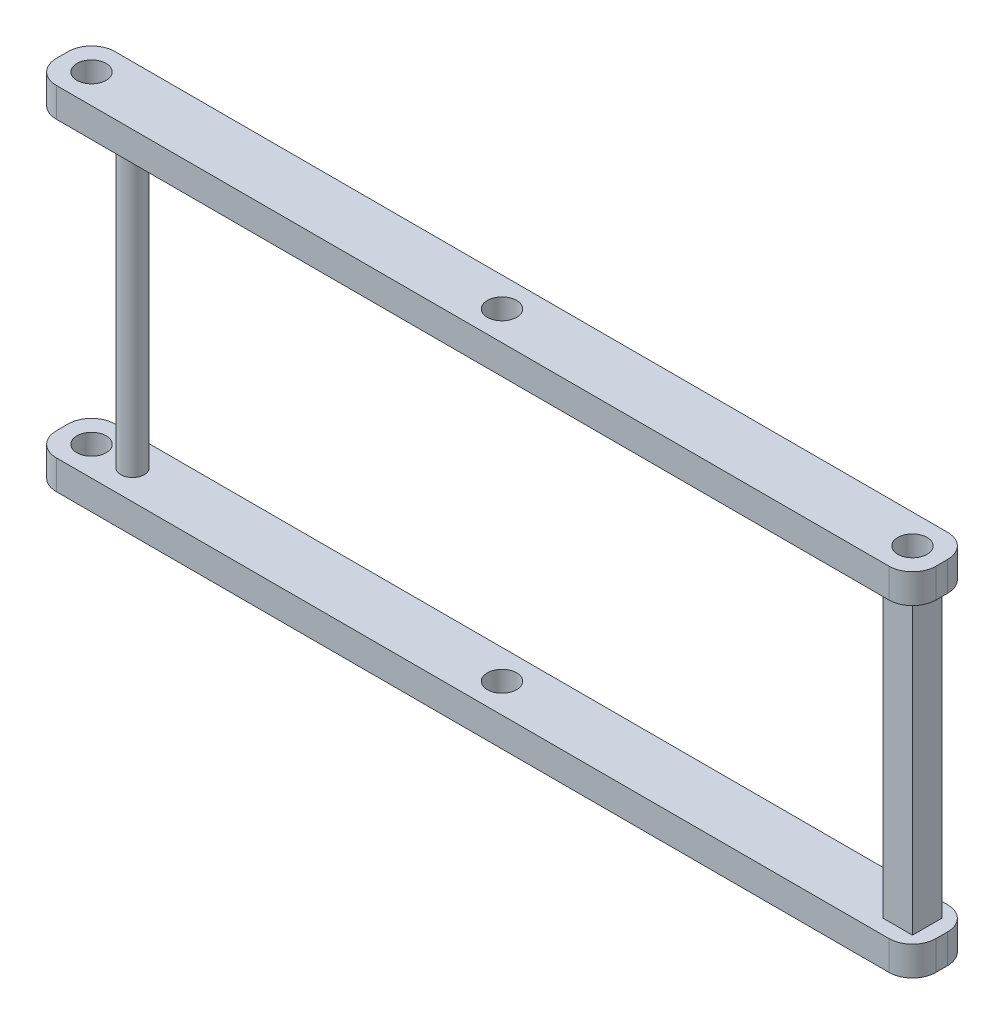
ISO-10303-21;
HEADER;
FILE_DESCRIPTION(('STEP AP214'),'2;1');
FILE_NAME('part.step','',(''),(''),'','','');
FILE_SCHEMA(('AUTOMOTIVE_DESIGN { 1 0 10303 214 1 1 1 1 }'));
ENDSEC;
DATA;
#1=APPLICATION_CONTEXT('core data for automotive mechanical design processes');
#2=APPLICATION_PROTOCOL_DEFINITION('international standard','automotive_design',2000,#1);
#3=PRODUCT_CONTEXT('',#1,'mechanical');
#4=PRODUCT('Part','Part','',(#3));
#5=PRODUCT_RELATED_PRODUCT_CATEGORY('part','',(#4));
#6=PRODUCT_DEFINITION_FORMATION('','',#4);
#7=PRODUCT_DEFINITION_CONTEXT('part definition',#1,'design');
#8=PRODUCT_DEFINITION('design','',#6,#7);
#9=PRODUCT_DEFINITION_SHAPE('','',#8);
#10=(LENGTH_UNIT() NAMED_UNIT(*) SI_UNIT(.MILLI.,.METRE.));
#11=(NAMED_UNIT(*) PLANE_ANGLE_UNIT() SI_UNIT($,.RADIAN.));
#12=(NAMED_UNIT(*) SI_UNIT($,.STERADIAN.) SOLID_ANGLE_UNIT());
#13=UNCERTAINTY_MEASURE_WITH_UNIT(LENGTH_MEASURE(1.E-05),#10,'distance_accuracy_value','');
#14=(GEOMETRIC_REPRESENTATION_CONTEXT(3) GLOBAL_UNCERTAINTY_ASSIGNED_CONTEXT((#13)) GLOBAL_UNIT_ASSIGNED_CONTEXT((#10,
#11,#12)) REPRESENTATION_CONTEXT('',''));
#15=CARTESIAN_POINT('',(0.,0.,0.));
#16=DIRECTION('',(0.,0.,1.));
#17=DIRECTION('',(1.,0.,0.));
#18=AXIS2_PLACEMENT_3D('',#15,#16,#17);
#19=CARTESIAN_POINT('',(-63.,4.99,0.));
#20=DIRECTION('',(0.,1.,0.));
#21=DIRECTION('',(0.,0.,1.));
#22=AXIS2_PLACEMENT_3D('',#19,#20,#21);
#23=CYLINDRICAL_SURFACE('',#22,2.);
#24=CARTESIAN_POINT('',(-63.,5.,0.));
#25=DIRECTION('',(0.,-1.,0.));
#26=DIRECTION('',(0.,0.,-1.));
#27=AXIS2_PLACEMENT_3D('',#24,#25,#26);
#28=CIRCLE('',#27,2.);
#29=CARTESIAN_POINT('',(-63.,5.,-1.99999999999999));
#30=VERTEX_POINT('',#29);
#31=EDGE_CURVE('E444',#30,#30,#28,.T.);
#32=ORIENTED_EDGE('',*,*,#31,.F.);
#33=EDGE_LOOP('',(#32));
#34=FACE_BOUND('',#33,.T.);
#35=CARTESIAN_POINT('',(-63.,54.999,0.));
#36=DIRECTION('',(0.,1.,0.));
#37=DIRECTION('',(0.,0.,1.));
#38=AXIS2_PLACEMENT_3D('',#35,#36,#37);
#39=CIRCLE('',#38,2.);
#40=CARTESIAN_POINT('',(-63.,54.999,2.00000000000001));
#41=VERTEX_POINT('',#40);
#42=EDGE_CURVE('E423',#41,#41,#39,.F.);
#43=ORIENTED_EDGE('',*,*,#42,.T.);
#44=EDGE_LOOP('',(#43));
#45=FACE_BOUND('',#44,.T.);
#46=ADVANCED_FACE('F194',(#34,#45),#23,.T.);
#47=CARTESIAN_POINT('',(67.5,4.99,-2.5));
#48=DIRECTION('',(0.,0.,1.));
#49=DIRECTION('',(1.,0.,0.));
#50=AXIS2_PLACEMENT_3D('',#47,#48,#49);
#51=PLANE('',#50);
#52=DIRECTION('',(-1.,0.,0.));
#53=VECTOR('',#52,1.);
#54=CARTESIAN_POINT('',(67.5,54.999,-2.5));
#55=LINE('',#54,#53);
#56=CARTESIAN_POINT('',(72.5,54.999,-2.5));
#57=VERTEX_POINT('',#56);
#58=CARTESIAN_POINT('',(67.5,54.999,-2.5));
#59=VERTEX_POINT('',#58);
#60=EDGE_CURVE('E209',#57,#59,#55,.T.);
#61=ORIENTED_EDGE('',*,*,#60,.F.);
#62=DIRECTION('',(0.,1.,0.));
#63=VECTOR('',#62,1.);
#64=CARTESIAN_POINT('',(72.5,4.99,-2.5));
#65=LINE('',#64,#63);
#66=CARTESIAN_POINT('',(72.5,5.,-2.5));
#67=VERTEX_POINT('',#66);
#68=EDGE_CURVE('E426',#67,#57,#65,.T.);
#69=ORIENTED_EDGE('',*,*,#68,.F.);
#70=DIRECTION('',(-1.,0.,0.));
#71=VECTOR('',#70,1.);
#72=CARTESIAN_POINT('',(0.,5.,-2.5));
#73=LINE('',#72,#71);
#74=CARTESIAN_POINT('',(67.5,5.,-2.5));
#75=VERTEX_POINT('',#74);
#76=EDGE_CURVE('E442',#67,#75,#73,.T.);
#77=ORIENTED_EDGE('',*,*,#76,.T.);
#78=DIRECTION('',(0.,1.,0.));
#79=VECTOR('',#78,1.);
#80=CARTESIAN_POINT('',(67.5,4.99,-2.5));
#81=LINE('',#80,#79);
#82=EDGE_CURVE('E433',#75,#59,#81,.T.);
#83=ORIENTED_EDGE('',*,*,#82,.T.);
#84=EDGE_LOOP('',(#61,#69,#77,#83));
#85=FACE_BOUND('',#84,.T.);
#86=ADVANCED_FACE('F554',(#85),#51,.F.);
#87=CARTESIAN_POINT('',(72.5,4.99,2.5));
#88=DIRECTION('',(1.,0.,0.));
#89=DIRECTION('',(0.,0.,-1.));
#90=AXIS2_PLACEMENT_3D('',#87,#88,#89);
#91=PLANE('',#90);
#92=ORIENTED_EDGE('',*,*,#68,.T.);
#93=DIRECTION('',(0.,0.,1.));
#94=VECTOR('',#93,1.);
#95=CARTESIAN_POINT('',(72.5,54.999,2.5));
#96=LINE('',#95,#94);
#97=CARTESIAN_POINT('',(72.5,54.999,2.5));
#98=VERTEX_POINT('',#97);
#99=EDGE_CURVE('E216',#57,#98,#96,.T.);
#100=ORIENTED_EDGE('',*,*,#99,.T.);
#101=DIRECTION('',(0.,1.,0.));
#102=VECTOR('',#101,1.);
#103=CARTESIAN_POINT('',(72.5,4.99,2.5));
#104=LINE('',#103,#102);
#105=CARTESIAN_POINT('',(72.5,5.,2.5));
#106=VERTEX_POINT('',#105);
#107=EDGE_CURVE('E428',#106,#98,#104,.T.);
#108=ORIENTED_EDGE('',*,*,#107,.F.);
#109=DIRECTION('',(0.,0.,1.));
#110=VECTOR('',#109,1.);
#111=CARTESIAN_POINT('',(72.5,5.,0.));
#112=LINE('',#111,#110);
#113=EDGE_CURVE('E440',#67,#106,#112,.T.);
#114=ORIENTED_EDGE('',*,*,#113,.F.);
#115=EDGE_LOOP('',(#92,#100,#108,#114));
#116=FACE_BOUND('',#115,.T.);
#117=ADVANCED_FACE('F560',(#116),#91,.T.);
#118=CARTESIAN_POINT('',(67.5,4.99,2.5));
#119=DIRECTION('',(0.,0.,1.));
#120=DIRECTION('',(1.,0.,0.));
#121=AXIS2_PLACEMENT_3D('',#118,#119,#120);
#122=PLANE('',#121);
#123=ORIENTED_EDGE('',*,*,#107,.T.);
#124=DIRECTION('',(-1.,0.,0.));
#125=VECTOR('',#124,1.);
#126=CARTESIAN_POINT('',(67.5,54.999,2.5));
#127=LINE('',#126,#125);
#128=CARTESIAN_POINT('',(67.5,54.999,2.5));
#129=VERTEX_POINT('',#128);
#130=EDGE_CURVE('E408',#98,#129,#127,.T.);
#131=ORIENTED_EDGE('',*,*,#130,.T.);
#132=DIRECTION('',(0.,1.,0.));
#133=VECTOR('',#132,1.);
#134=CARTESIAN_POINT('',(67.5,4.99,2.5));
#135=LINE('',#134,#133);
#136=CARTESIAN_POINT('',(67.5,5.,2.5));
#137=VERTEX_POINT('',#136);
#138=EDGE_CURVE('E430',#137,#129,#135,.T.);
#139=ORIENTED_EDGE('',*,*,#138,.F.);
#140=DIRECTION('',(-1.,0.,0.));
#141=VECTOR('',#140,1.);
#142=CARTESIAN_POINT('',(0.,5.,2.5));
#143=LINE('',#142,#141);
#144=EDGE_CURVE('E438',#106,#137,#143,.T.);
#145=ORIENTED_EDGE('',*,*,#144,.F.);
#146=EDGE_LOOP('',(#123,#131,#139,#145));
#147=FACE_BOUND('',#146,.T.);
#148=ADVANCED_FACE('F657',(#147),#122,.T.);
#149=CARTESIAN_POINT('',(67.5,4.99,2.5));
#150=DIRECTION('',(1.,0.,0.));
#151=DIRECTION('',(0.,0.,-1.));
#152=AXIS2_PLACEMENT_3D('',#149,#150,#151);
#153=PLANE('',#152);
#154=DIRECTION('',(0.,0.,1.));
#155=VECTOR('',#154,1.);
#156=CARTESIAN_POINT('',(67.5,54.999,2.5));
#157=LINE('',#156,#155);
#158=EDGE_CURVE('E12',#59,#129,#157,.T.);
#159=ORIENTED_EDGE('',*,*,#158,.F.);
#160=ORIENTED_EDGE('',*,*,#82,.F.);
#161=DIRECTION('',(0.,0.,1.));
#162=VECTOR('',#161,1.);
#163=CARTESIAN_POINT('',(67.5,5.,0.));
#164=LINE('',#163,#162);
#165=EDGE_CURVE('E435',#75,#137,#164,.T.);
#166=ORIENTED_EDGE('',*,*,#165,.T.);
#167=ORIENTED_EDGE('',*,*,#138,.T.);
#168=EDGE_LOOP('',(#159,#160,#166,#167));
#169=FACE_BOUND('',#168,.T.);
#170=ADVANCED_FACE('F584',(#169),#153,.F.);
#171=CARTESIAN_POINT('',(0.,5.,0.));
#172=DIRECTION('',(0.,-1.,0.));
#173=DIRECTION('',(0.,0.,-1.));
#174=AXIS2_PLACEMENT_3D('',#171,#172,#173);
#175=PLANE('',#174);
#176=ORIENTED_EDGE('',*,*,#31,.T.);
#177=EDGE_LOOP('',(#176));
#178=FACE_BOUND('',#177,.T.);
#179=DIRECTION('',(1.,0.,0.));
#180=VECTOR('',#179,1.);
#181=CARTESIAN_POINT('',(-75.,5.,5.00000000000002));
#182=LINE('',#181,#180);
#183=CARTESIAN_POINT('',(-71.,5.,5.00000000000002));
#184=VERTEX_POINT('',#183);
#185=CARTESIAN_POINT('',(71.,5.,5.));
#186=VERTEX_POINT('',#185);
#187=EDGE_CURVE('E471',#184,#186,#182,.T.);
#188=ORIENTED_EDGE('',*,*,#187,.T.);
#189=CARTESIAN_POINT('',(71.,5.,0.999999999999998));
#190=DIRECTION('',(0.,-1.,0.));
#191=DIRECTION('',(0.,0.,-1.));
#192=AXIS2_PLACEMENT_3D('',#189,#190,#191);
#193=CIRCLE('',#192,4.);
#194=CARTESIAN_POINT('',(75.,5.,0.999999999999998));
#195=VERTEX_POINT('',#194);
#196=EDGE_CURVE('E508',#186,#195,#193,.F.);
#197=ORIENTED_EDGE('',*,*,#196,.T.);
#198=DIRECTION('',(0.,0.,-1.));
#199=VECTOR('',#198,1.);
#200=CARTESIAN_POINT('',(75.,5.,5.));
#201=LINE('',#200,#199);
#202=CARTESIAN_POINT('',(75.,5.,-1.00000000000001));
#203=VERTEX_POINT('',#202);
#204=EDGE_CURVE('E461',#195,#203,#201,.T.);
#205=ORIENTED_EDGE('',*,*,#204,.T.);
#206=CARTESIAN_POINT('',(71.,5.,-1.00000000000001));
#207=DIRECTION('',(0.,-1.,0.));
#208=DIRECTION('',(0.,0.,-1.));
#209=AXIS2_PLACEMENT_3D('',#206,#207,#208);
#210=CIRCLE('',#209,4.);
#211=CARTESIAN_POINT('',(71.,5.,-5.00000000000002));
#212=VERTEX_POINT('',#211);
#213=EDGE_CURVE('E506',#203,#212,#210,.F.);
#214=ORIENTED_EDGE('',*,*,#213,.T.);
#215=DIRECTION('',(-1.,0.,0.));
#216=VECTOR('',#215,1.);
#217=CARTESIAN_POINT('',(-75.,5.,-4.99999999999998));
#218=LINE('',#217,#216);
#219=CARTESIAN_POINT('',(-71.,5.,-4.99999999999999));
#220=VERTEX_POINT('',#219);
#221=EDGE_CURVE('E464',#212,#220,#218,.T.);
#222=ORIENTED_EDGE('',*,*,#221,.T.);
#223=CARTESIAN_POINT('',(-71.,5.,-0.999999999999985));
#224=DIRECTION('',(0.,-1.,0.));
#225=DIRECTION('',(0.,0.,-1.));
#226=AXIS2_PLACEMENT_3D('',#223,#224,#225);
#227=CIRCLE('',#226,4.);
#228=CARTESIAN_POINT('',(-75.,5.,-0.999999999999985));
#229=VERTEX_POINT('',#228);
#230=EDGE_CURVE('E504',#220,#229,#227,.F.);
#231=ORIENTED_EDGE('',*,*,#230,.T.);
#232=DIRECTION('',(0.,0.,1.));
#233=VECTOR('',#232,1.);
#234=CARTESIAN_POINT('',(-75.,5.,5.00000000000002));
#235=LINE('',#234,#233);
#236=CARTESIAN_POINT('',(-75.,5.,1.00000000000002));
#237=VERTEX_POINT('',#236);
#238=EDGE_CURVE('E468',#229,#237,#235,.T.);
#239=ORIENTED_EDGE('',*,*,#238,.T.);
#240=CARTESIAN_POINT('',(-71.,5.,1.00000000000002));
#241=DIRECTION('',(0.,-1.,0.));
#242=DIRECTION('',(0.,0.,-1.));
#243=AXIS2_PLACEMENT_3D('',#240,#241,#242);
#244=CIRCLE('',#243,4.);
#245=EDGE_CURVE('E502',#237,#184,#244,.F.);
#246=ORIENTED_EDGE('',*,*,#245,.T.);
#247=EDGE_LOOP('',(#188,#197,#205,#214,#222,#231,#239,#246));
#248=FACE_BOUND('',#247,.T.);
#249=CARTESIAN_POINT('',(-70.,5.,0.));
#250=DIRECTION('',(0.,1.,0.));
#251=DIRECTION('',(0.,0.,1.));
#252=AXIS2_PLACEMENT_3D('',#249,#250,#251);
#253=CIRCLE('',#252,2.50000000000001);
#254=CARTESIAN_POINT('',(-70.,5.,2.50000000000002));
#255=VERTEX_POINT('',#254);
#256=EDGE_CURVE('E455',#255,#255,#253,.T.);
#257=ORIENTED_EDGE('',*,*,#256,.F.);
#258=EDGE_LOOP('',(#257));
#259=FACE_BOUND('',#258,.T.);
#260=CARTESIAN_POINT('',(0.,5.,0.));
#261=DIRECTION('',(0.,1.,0.));
#262=DIRECTION('',(0.,0.,1.));
#263=AXIS2_PLACEMENT_3D('',#260,#261,#262);
#264=CIRCLE('',#263,2.5);
#265=CARTESIAN_POINT('',(0.,5.,2.5));
#266=VERTEX_POINT('',#265);
#267=EDGE_CURVE('E445',#266,#266,#264,.T.);
#268=ORIENTED_EDGE('',*,*,#267,.F.);
#269=EDGE_LOOP('',(#268));
#270=FACE_BOUND('',#269,.T.);
#271=ORIENTED_EDGE('',*,*,#76,.F.);
#272=ORIENTED_EDGE('',*,*,#113,.T.);
#273=ORIENTED_EDGE('',*,*,#144,.T.);
#274=ORIENTED_EDGE('',*,*,#165,.F.);
#275=EDGE_LOOP('',(#271,#272,#273,#274));
#276=FACE_BOUND('',#275,.T.);
#277=ADVANCED_FACE('F576',(#178,#248,#259,#270,#276),#175,.F.);
#278=CARTESIAN_POINT('',(70.,5.,0.));
#279=DIRECTION('',(0.,-1.,0.));
#280=DIRECTION('',(0.,0.,-1.));
#281=AXIS2_PLACEMENT_3D('',#278,#279,#280);
#282=CYLINDRICAL_SURFACE('',#281,2.50000000000001);
#283=CARTESIAN_POINT('',(70.,0.,0.));
#284=DIRECTION('',(0.,1.,0.));
#285=DIRECTION('',(0.,0.,-1.));
#286=AXIS2_PLACEMENT_3D('',#283,#284,#285);
#287=CIRCLE('',#286,2.50000000000001);
#288=CARTESIAN_POINT('',(70.,0.,-2.50000000000001));
#289=VERTEX_POINT('',#288);
#290=EDGE_CURVE('E448',#289,#289,#287,.T.);
#291=ORIENTED_EDGE('',*,*,#290,.F.);
#292=EDGE_LOOP('',(#291));
#293=FACE_BOUND('',#292,.T.);
#294=CARTESIAN_POINT('',(70.,4.99,0.));
#295=DIRECTION('',(0.,1.,0.));
#296=DIRECTION('',(0.,0.,1.));
#297=AXIS2_PLACEMENT_3D('',#294,#295,#296);
#298=CIRCLE('',#297,2.50000000000001);
#299=CARTESIAN_POINT('',(70.,4.99,2.50000000000001));
#300=VERTEX_POINT('',#299);
#301=EDGE_CURVE('E520',#300,#300,#298,.T.);
#302=ORIENTED_EDGE('',*,*,#301,.T.);
#303=EDGE_LOOP('',(#302));
#304=FACE_BOUND('',#303,.T.);
#305=ADVANCED_FACE('F572',(#293,#304),#282,.F.);
#306=CARTESIAN_POINT('',(0.,0.,0.));
#307=DIRECTION('',(0.,-1.,0.));
#308=DIRECTION('',(0.,0.,-1.));
#309=AXIS2_PLACEMENT_3D('',#306,#307,#308);
#310=PLANE('',#309);
#311=ORIENTED_EDGE('',*,*,#290,.T.);
#312=EDGE_LOOP('',(#311));
#313=FACE_BOUND('',#312,.T.);
#314=DIRECTION('',(0.,0.,-1.));
#315=VECTOR('',#314,1.);
#316=CARTESIAN_POINT('',(75.,0.,5.));
#317=LINE('',#316,#315);
#318=CARTESIAN_POINT('',(75.,0.,0.999999999999998));
#319=VERTEX_POINT('',#318);
#320=CARTESIAN_POINT('',(75.,0.,-1.00000000000001));
#321=VERTEX_POINT('',#320);
#322=EDGE_CURVE('E458',#319,#321,#317,.T.);
#323=ORIENTED_EDGE('',*,*,#322,.F.);
#324=CARTESIAN_POINT('',(71.,0.,0.999999999999998));
#325=DIRECTION('',(0.,-1.,0.));
#326=DIRECTION('',(0.,0.,-1.));
#327=AXIS2_PLACEMENT_3D('',#324,#325,#326);
#328=CIRCLE('',#327,4.);
#329=CARTESIAN_POINT('',(71.,0.,5.));
#330=VERTEX_POINT('',#329);
#331=EDGE_CURVE('E495',#319,#330,#328,.T.);
#332=ORIENTED_EDGE('',*,*,#331,.T.);
#333=DIRECTION('',(1.,0.,0.));
#334=VECTOR('',#333,1.);
#335=CARTESIAN_POINT('',(-75.,0.,5.00000000000002));
#336=LINE('',#335,#334);
#337=CARTESIAN_POINT('',(-71.,0.,5.00000000000002));
#338=VERTEX_POINT('',#337);
#339=EDGE_CURVE('E465',#338,#330,#336,.T.);
#340=ORIENTED_EDGE('',*,*,#339,.F.);
#341=CARTESIAN_POINT('',(-71.,0.,1.00000000000002));
#342=DIRECTION('',(0.,-1.,0.));
#343=DIRECTION('',(0.,0.,-1.));
#344=AXIS2_PLACEMENT_3D('',#341,#342,#343);
#345=CIRCLE('',#344,4.);
#346=CARTESIAN_POINT('',(-75.,0.,1.00000000000002));
#347=VERTEX_POINT('',#346);
#348=EDGE_CURVE('E489',#338,#347,#345,.T.);
#349=ORIENTED_EDGE('',*,*,#348,.T.);
#350=DIRECTION('',(0.,0.,1.));
#351=VECTOR('',#350,1.);
#352=CARTESIAN_POINT('',(-75.,0.,5.00000000000002));
#353=LINE('',#352,#351);
#354=CARTESIAN_POINT('',(-75.,0.,-0.999999999999985));
#355=VERTEX_POINT('',#354);
#356=EDGE_CURVE('E480',#355,#347,#353,.T.);
#357=ORIENTED_EDGE('',*,*,#356,.F.);
#358=CARTESIAN_POINT('',(-71.,0.,-0.999999999999985));
#359=DIRECTION('',(0.,-1.,0.));
#360=DIRECTION('',(0.,0.,-1.));
#361=AXIS2_PLACEMENT_3D('',#358,#359,#360);
#362=CIRCLE('',#361,4.);
#363=CARTESIAN_POINT('',(-71.,0.,-4.99999999999999));
#364=VERTEX_POINT('',#363);
#365=EDGE_CURVE('E491',#355,#364,#362,.T.);
#366=ORIENTED_EDGE('',*,*,#365,.T.);
#367=DIRECTION('',(-1.,0.,0.));
#368=VECTOR('',#367,1.);
#369=CARTESIAN_POINT('',(-75.,0.,-4.99999999999998));
#370=LINE('',#369,#368);
#371=CARTESIAN_POINT('',(71.,0.,-5.00000000000002));
#372=VERTEX_POINT('',#371);
#373=EDGE_CURVE('E477',#372,#364,#370,.T.);
#374=ORIENTED_EDGE('',*,*,#373,.F.);
#375=CARTESIAN_POINT('',(71.,0.,-1.00000000000001));
#376=DIRECTION('',(0.,-1.,0.));
#377=DIRECTION('',(0.,0.,-1.));
#378=AXIS2_PLACEMENT_3D('',#375,#376,#377);
#379=CIRCLE('',#378,4.);
#380=EDGE_CURVE('E493',#372,#321,#379,.T.);
#381=ORIENTED_EDGE('',*,*,#380,.T.);
#382=EDGE_LOOP('',(#323,#332,#340,#349,#357,#366,#374,#381));
#383=FACE_BOUND('',#382,.T.);
#384=CARTESIAN_POINT('',(-70.,0.,0.));
#385=DIRECTION('',(0.,1.,0.));
#386=DIRECTION('',(0.,0.,1.));
#387=AXIS2_PLACEMENT_3D('',#384,#385,#386);
#388=CIRCLE('',#387,2.50000000000001);
#389=CARTESIAN_POINT('',(-70.,0.,2.50000000000002));
#390=VERTEX_POINT('',#389);
#391=EDGE_CURVE('E454',#390,#390,#388,.T.);
#392=ORIENTED_EDGE('',*,*,#391,.T.);
#393=EDGE_LOOP('',(#392));
#394=FACE_BOUND('',#393,.T.);
#395=CARTESIAN_POINT('',(0.,0.,0.));
#396=DIRECTION('',(0.,1.,0.));
#397=DIRECTION('',(0.,0.,1.));
#398=AXIS2_PLACEMENT_3D('',#395,#396,#397);
#399=CIRCLE('',#398,2.5);
#400=CARTESIAN_POINT('',(0.,0.,2.5));
#401=VERTEX_POINT('',#400);
#402=EDGE_CURVE('E449',#401,#401,#399,.T.);
#403=ORIENTED_EDGE('',*,*,#402,.T.);
#404=EDGE_LOOP('',(#403));
#405=FACE_BOUND('',#404,.T.);
#406=ADVANCED_FACE('F575',(#313,#383,#394,#405),#310,.T.);
#407=CARTESIAN_POINT('',(75.,5.,5.));
#408=DIRECTION('',(-1.,0.,0.));
#409=DIRECTION('',(0.,0.,1.));
#410=AXIS2_PLACEMENT_3D('',#407,#408,#409);
#411=PLANE('',#410);
#412=ORIENTED_EDGE('',*,*,#204,.F.);
#413=DIRECTION('',(0.,-1.,0.));
#414=VECTOR('',#413,1.);
#415=CARTESIAN_POINT('',(75.,5.,0.999999999999998));
#416=LINE('',#415,#414);
#417=EDGE_CURVE('E486',#195,#319,#416,.T.);
#418=ORIENTED_EDGE('',*,*,#417,.T.);
#419=ORIENTED_EDGE('',*,*,#322,.T.);
#420=DIRECTION('',(0.,-1.,0.));
#421=VECTOR('',#420,1.);
#422=CARTESIAN_POINT('',(75.,5.,-1.00000000000001));
#423=LINE('',#422,#421);
#424=EDGE_CURVE('E474',#321,#203,#423,.F.);
#425=ORIENTED_EDGE('',*,*,#424,.T.);
#426=EDGE_LOOP('',(#412,#418,#419,#425));
#427=FACE_BOUND('',#426,.T.);
#428=ADVANCED_FACE('F588',(#427),#411,.F.);
#429=CARTESIAN_POINT('',(-75.,5.,-4.99999999999998));
#430=DIRECTION('',(0.,0.,1.));
#431=DIRECTION('',(1.,0.,0.));
#432=AXIS2_PLACEMENT_3D('',#429,#430,#431);
#433=PLANE('',#432);
#434=ORIENTED_EDGE('',*,*,#221,.F.);
#435=DIRECTION('',(0.,-1.,0.));
#436=VECTOR('',#435,1.);
#437=CARTESIAN_POINT('',(71.,5.,-5.00000000000002));
#438=LINE('',#437,#436);
#439=EDGE_CURVE('E512',#212,#372,#438,.T.);
#440=ORIENTED_EDGE('',*,*,#439,.T.);
#441=ORIENTED_EDGE('',*,*,#373,.T.);
#442=DIRECTION('',(0.,-1.,0.));
#443=VECTOR('',#442,1.);
#444=CARTESIAN_POINT('',(-71.,5.,-4.99999999999999));
#445=LINE('',#444,#443);
#446=EDGE_CURVE('E510',#364,#220,#445,.F.);
#447=ORIENTED_EDGE('',*,*,#446,.T.);
#448=EDGE_LOOP('',(#434,#440,#441,#447));
#449=FACE_BOUND('',#448,.T.);
#450=ADVANCED_FACE('F596',(#449),#433,.F.);
#451=CARTESIAN_POINT('',(-75.,5.,5.00000000000002));
#452=DIRECTION('',(1.,0.,0.));
#453=DIRECTION('',(0.,0.,-1.));
#454=AXIS2_PLACEMENT_3D('',#451,#452,#453);
#455=PLANE('',#454);
#456=ORIENTED_EDGE('',*,*,#238,.F.);
#457=DIRECTION('',(0.,-1.,0.));
#458=VECTOR('',#457,1.);
#459=CARTESIAN_POINT('',(-75.,5.,-0.999999999999985));
#460=LINE('',#459,#458);
#461=EDGE_CURVE('E517',#229,#355,#460,.T.);
#462=ORIENTED_EDGE('',*,*,#461,.T.);
#463=ORIENTED_EDGE('',*,*,#356,.T.);
#464=DIRECTION('',(0.,-1.,0.));
#465=VECTOR('',#464,1.);
#466=CARTESIAN_POINT('',(-75.,5.,1.00000000000002));
#467=LINE('',#466,#465);
#468=EDGE_CURVE('E515',#347,#237,#467,.F.);
#469=ORIENTED_EDGE('',*,*,#468,.T.);
#470=EDGE_LOOP('',(#456,#462,#463,#469));
#471=FACE_BOUND('',#470,.T.);
#472=ADVANCED_FACE('F592',(#471),#455,.F.);
#473=CARTESIAN_POINT('',(-75.,5.,5.00000000000002));
#474=DIRECTION('',(0.,0.,-1.));
#475=DIRECTION('',(-1.,0.,0.));
#476=AXIS2_PLACEMENT_3D('',#473,#474,#475);
#477=PLANE('',#476);
#478=ORIENTED_EDGE('',*,*,#339,.T.);
#479=DIRECTION('',(0.,-1.,0.));
#480=VECTOR('',#479,1.);
#481=CARTESIAN_POINT('',(71.,5.,5.));
#482=LINE('',#481,#480);
#483=EDGE_CURVE('E500',#330,#186,#482,.F.);
#484=ORIENTED_EDGE('',*,*,#483,.T.);
#485=ORIENTED_EDGE('',*,*,#187,.F.);
#486=DIRECTION('',(0.,-1.,0.));
#487=VECTOR('',#486,1.);
#488=CARTESIAN_POINT('',(-71.,5.,5.00000000000002));
#489=LINE('',#488,#487);
#490=EDGE_CURVE('E497',#184,#338,#489,.T.);
#491=ORIENTED_EDGE('',*,*,#490,.T.);
#492=EDGE_LOOP('',(#478,#484,#485,#491));
#493=FACE_BOUND('',#492,.T.);
#494=ADVANCED_FACE('F580',(#493),#477,.F.);
#495=CARTESIAN_POINT('',(-70.,5.,0.));
#496=DIRECTION('',(0.,-1.,0.));
#497=DIRECTION('',(0.,0.,-1.));
#498=AXIS2_PLACEMENT_3D('',#495,#496,#497);
#499=CYLINDRICAL_SURFACE('',#498,2.50000000000001);
#500=ORIENTED_EDGE('',*,*,#256,.T.);
#501=EDGE_LOOP('',(#500));
#502=FACE_BOUND('',#501,.T.);
#503=ORIENTED_EDGE('',*,*,#391,.F.);
#504=EDGE_LOOP('',(#503));
#505=FACE_BOUND('',#504,.T.);
#506=ADVANCED_FACE('F570',(#502,#505),#499,.F.);
#507=CARTESIAN_POINT('',(0.,5.,0.));
#508=DIRECTION('',(0.,-1.,0.));
#509=DIRECTION('',(0.,0.,-1.));
#510=AXIS2_PLACEMENT_3D('',#507,#508,#509);
#511=CYLINDRICAL_SURFACE('',#510,2.5);
#512=ORIENTED_EDGE('',*,*,#267,.T.);
#513=EDGE_LOOP('',(#512));
#514=FACE_BOUND('',#513,.T.);
#515=ORIENTED_EDGE('',*,*,#402,.F.);
#516=EDGE_LOOP('',(#515));
#517=FACE_BOUND('',#516,.T.);
#518=ADVANCED_FACE('F566',(#514,#517),#511,.F.);
#519=CARTESIAN_POINT('',(71.,5.,0.999999999999998));
#520=DIRECTION('',(0.,-1.,0.));
#521=DIRECTION('',(0.,0.,-1.));
#522=AXIS2_PLACEMENT_3D('',#519,#520,#521);
#523=CYLINDRICAL_SURFACE('',#522,4.);
#524=ORIENTED_EDGE('',*,*,#196,.F.);
#525=ORIENTED_EDGE('',*,*,#483,.F.);
#526=ORIENTED_EDGE('',*,*,#331,.F.);
#527=ORIENTED_EDGE('',*,*,#417,.F.);
#528=EDGE_LOOP('',(#524,#525,#526,#527));
#529=FACE_BOUND('',#528,.T.);
#530=ADVANCED_FACE('F569',(#529),#523,.T.);
#531=CARTESIAN_POINT('',(71.,5.,-1.00000000000001));
#532=DIRECTION('',(0.,-1.,0.));
#533=DIRECTION('',(0.,0.,-1.));
#534=AXIS2_PLACEMENT_3D('',#531,#532,#533);
#535=CYLINDRICAL_SURFACE('',#534,4.);
#536=ORIENTED_EDGE('',*,*,#213,.F.);
#537=ORIENTED_EDGE('',*,*,#424,.F.);
#538=ORIENTED_EDGE('',*,*,#380,.F.);
#539=ORIENTED_EDGE('',*,*,#439,.F.);
#540=EDGE_LOOP('',(#536,#537,#538,#539));
#541=FACE_BOUND('',#540,.T.);
#542=ADVANCED_FACE('F606',(#541),#535,.T.);
#543=CARTESIAN_POINT('',(-71.,5.,-0.999999999999985));
#544=DIRECTION('',(0.,-1.,0.));
#545=DIRECTION('',(0.,0.,-1.));
#546=AXIS2_PLACEMENT_3D('',#543,#544,#545);
#547=CYLINDRICAL_SURFACE('',#546,4.);
#548=ORIENTED_EDGE('',*,*,#230,.F.);
#549=ORIENTED_EDGE('',*,*,#446,.F.);
#550=ORIENTED_EDGE('',*,*,#365,.F.);
#551=ORIENTED_EDGE('',*,*,#461,.F.);
#552=EDGE_LOOP('',(#548,#549,#550,#551));
#553=FACE_BOUND('',#552,.T.);
#554=ADVANCED_FACE('F609',(#553),#547,.T.);
#555=CARTESIAN_POINT('',(-71.,5.,1.00000000000002));
#556=DIRECTION('',(0.,-1.,0.));
#557=DIRECTION('',(0.,0.,-1.));
#558=AXIS2_PLACEMENT_3D('',#555,#556,#557);
#559=CYLINDRICAL_SURFACE('',#558,4.);
#560=ORIENTED_EDGE('',*,*,#245,.F.);
#561=ORIENTED_EDGE('',*,*,#468,.F.);
#562=ORIENTED_EDGE('',*,*,#348,.F.);
#563=ORIENTED_EDGE('',*,*,#490,.F.);
#564=EDGE_LOOP('',(#560,#561,#562,#563));
#565=FACE_BOUND('',#564,.T.);
#566=ADVANCED_FACE('F196',(#565),#559,.T.);
#567=CARTESIAN_POINT('',(0.,4.99,0.));
#568=DIRECTION('',(0.,1.,0.));
#569=DIRECTION('',(0.,0.,1.));
#570=AXIS2_PLACEMENT_3D('',#567,#568,#569);
#571=PLANE('',#570);
#572=ORIENTED_EDGE('',*,*,#301,.F.);
#573=EDGE_LOOP('',(#572));
#574=FACE_BOUND('',#573,.T.);
#575=ADVANCED_FACE('F616',(#574),#571,.F.);
#576=CARTESIAN_POINT('',(-71.,54.999,-0.999999999999985));
#577=DIRECTION('',(0.,1.,0.));
#578=DIRECTION('',(0.,0.,1.));
#579=AXIS2_PLACEMENT_3D('',#576,#577,#578);
#580=PLANE('',#579);
#581=ORIENTED_EDGE('',*,*,#42,.F.);
#582=EDGE_LOOP('',(#581));
#583=FACE_BOUND('',#582,.T.);
#584=CARTESIAN_POINT('',(0.,54.999,0.));
#585=DIRECTION('',(0.,1.,0.));
#586=DIRECTION('',(0.,0.,1.));
#587=AXIS2_PLACEMENT_3D('',#584,#585,#586);
#588=CIRCLE('',#587,2.5);
#589=CARTESIAN_POINT('',(0.,54.999,2.5));
#590=VERTEX_POINT('',#589);
#591=EDGE_CURVE('E380',#590,#590,#588,.T.);
#592=ORIENTED_EDGE('',*,*,#591,.T.);
#593=EDGE_LOOP('',(#592));
#594=FACE_BOUND('',#593,.T.);
#595=CARTESIAN_POINT('',(-70.,54.999,0.));
#596=DIRECTION('',(0.,1.,0.));
#597=DIRECTION('',(0.,0.,1.));
#598=AXIS2_PLACEMENT_3D('',#595,#596,#597);
#599=CIRCLE('',#598,2.50000000000001);
#600=CARTESIAN_POINT('',(-70.,54.999,2.50000000000002));
#601=VERTEX_POINT('',#600);
#602=EDGE_CURVE('E383',#601,#601,#599,.T.);
#603=ORIENTED_EDGE('',*,*,#602,.T.);
#604=EDGE_LOOP('',(#603));
#605=FACE_BOUND('',#604,.T.);
#606=CARTESIAN_POINT('',(-71.,54.999,-0.999999999999985));
#607=DIRECTION('',(0.,1.,0.));
#608=DIRECTION('',(0.,0.,1.));
#609=AXIS2_PLACEMENT_3D('',#606,#607,#608);
#610=CIRCLE('',#609,4.);
#611=CARTESIAN_POINT('',(-71.,54.999,-4.99999999999999));
#612=VERTEX_POINT('',#611);
#613=CARTESIAN_POINT('',(-75.,54.999,-0.999999999999985));
#614=VERTEX_POINT('',#613);
#615=EDGE_CURVE('E339',#612,#614,#610,.T.);
#616=ORIENTED_EDGE('',*,*,#615,.F.);
#617=DIRECTION('',(-1.,0.,0.));
#618=VECTOR('',#617,1.);
#619=CARTESIAN_POINT('',(71.,54.999,-5.00000000000002));
#620=LINE('',#619,#618);
#621=CARTESIAN_POINT('',(71.,54.999,-5.00000000000002));
#622=VERTEX_POINT('',#621);
#623=EDGE_CURVE('E344',#622,#612,#620,.T.);
#624=ORIENTED_EDGE('',*,*,#623,.F.);
#625=CARTESIAN_POINT('',(71.,54.999,-1.00000000000001));
#626=DIRECTION('',(0.,1.,0.));
#627=DIRECTION('',(0.,0.,1.));
#628=AXIS2_PLACEMENT_3D('',#625,#626,#627);
#629=CIRCLE('',#628,4.);
#630=CARTESIAN_POINT('',(75.,54.999,-1.00000000000001));
#631=VERTEX_POINT('',#630);
#632=EDGE_CURVE('E401',#631,#622,#629,.T.);
#633=ORIENTED_EDGE('',*,*,#632,.F.);
#634=DIRECTION('',(0.,0.,-1.));
#635=VECTOR('',#634,1.);
#636=CARTESIAN_POINT('',(75.,54.999,0.999999999999998));
#637=LINE('',#636,#635);
#638=CARTESIAN_POINT('',(75.,54.999,0.999999999999999));
#639=VERTEX_POINT('',#638);
#640=EDGE_CURVE('E398',#639,#631,#637,.T.);
#641=ORIENTED_EDGE('',*,*,#640,.F.);
#642=CARTESIAN_POINT('',(71.,54.999,0.999999999999998));
#643=DIRECTION('',(0.,1.,0.));
#644=DIRECTION('',(0.,0.,1.));
#645=AXIS2_PLACEMENT_3D('',#642,#643,#644);
#646=CIRCLE('',#645,4.);
#647=CARTESIAN_POINT('',(71.,54.999,5.));
#648=VERTEX_POINT('',#647);
#649=EDGE_CURVE('E395',#648,#639,#646,.T.);
#650=ORIENTED_EDGE('',*,*,#649,.F.);
#651=DIRECTION('',(1.,0.,0.));
#652=VECTOR('',#651,1.);
#653=CARTESIAN_POINT('',(-71.,54.999,5.00000000000002));
#654=LINE('',#653,#652);
#655=CARTESIAN_POINT('',(-71.,54.999,5.00000000000002));
#656=VERTEX_POINT('',#655);
#657=EDGE_CURVE('E392',#656,#648,#654,.T.);
#658=ORIENTED_EDGE('',*,*,#657,.F.);
#659=CARTESIAN_POINT('',(-71.,54.999,1.00000000000002));
#660=DIRECTION('',(0.,1.,0.));
#661=DIRECTION('',(0.,0.,1.));
#662=AXIS2_PLACEMENT_3D('',#659,#660,#661);
#663=CIRCLE('',#662,4.);
#664=CARTESIAN_POINT('',(-75.,54.999,1.00000000000002));
#665=VERTEX_POINT('',#664);
#666=EDGE_CURVE('E389',#665,#656,#663,.T.);
#667=ORIENTED_EDGE('',*,*,#666,.F.);
#668=DIRECTION('',(0.,0.,1.));
#669=VECTOR('',#668,1.);
#670=CARTESIAN_POINT('',(-75.,54.999,-0.999999999999985));
#671=LINE('',#670,#669);
#672=EDGE_CURVE('E387',#614,#665,#671,.T.);
#673=ORIENTED_EDGE('',*,*,#672,.F.);
#674=EDGE_LOOP('',(#616,#624,#633,#641,#650,#658,#667,#673));
#675=FACE_BOUND('',#674,.T.);
#676=ORIENTED_EDGE('',*,*,#99,.F.);
#677=ORIENTED_EDGE('',*,*,#60,.T.);
#678=ORIENTED_EDGE('',*,*,#158,.T.);
#679=ORIENTED_EDGE('',*,*,#130,.F.);
#680=EDGE_LOOP('',(#676,#677,#678,#679));
#681=FACE_BOUND('',#680,.T.);
#682=ADVANCED_FACE('F660',(#583,#594,#605,#675,#681),#580,.F.);
#683=CARTESIAN_POINT('',(-71.,54.999,-0.999999999999985));
#684=DIRECTION('',(0.,1.,0.));
#685=DIRECTION('',(0.,0.,1.));
#686=AXIS2_PLACEMENT_3D('',#683,#684,#685);
#687=CYLINDRICAL_SURFACE('',#686,4.);
#688=DIRECTION('',(0.,1.,0.));
#689=VECTOR('',#688,1.);
#690=CARTESIAN_POINT('',(-75.,54.999,-0.999999999999985));
#691=LINE('',#690,#689);
#692=CARTESIAN_POINT('',(-75.,60.,-0.999999999999985));
#693=VERTEX_POINT('',#692);
#694=EDGE_CURVE('E333',#614,#693,#691,.T.);
#695=ORIENTED_EDGE('',*,*,#694,.T.);
#696=CARTESIAN_POINT('',(-71.,60.,-0.999999999999985));
#697=DIRECTION('',(0.,1.,0.));
#698=DIRECTION('',(0.,0.,1.));
#699=AXIS2_PLACEMENT_3D('',#696,#697,#698);
#700=CIRCLE('',#699,4.);
#701=CARTESIAN_POINT('',(-71.,60.,-4.99999999999999));
#702=VERTEX_POINT('',#701);
#703=EDGE_CURVE('E337',#702,#693,#700,.T.);
#704=ORIENTED_EDGE('',*,*,#703,.F.);
#705=DIRECTION('',(0.,1.,0.));
#706=VECTOR('',#705,1.);
#707=CARTESIAN_POINT('',(-71.,54.999,-4.99999999999999));
#708=LINE('',#707,#706);
#709=EDGE_CURVE('E406',#612,#702,#708,.T.);
#710=ORIENTED_EDGE('',*,*,#709,.F.);
#711=ORIENTED_EDGE('',*,*,#615,.T.);
#712=EDGE_LOOP('',(#695,#704,#710,#711));
#713=FACE_BOUND('',#712,.T.);
#714=ADVANCED_FACE('F335',(#713),#687,.T.);
#715=CARTESIAN_POINT('',(71.,54.999,-5.00000000000002));
#716=DIRECTION('',(0.,0.,-1.));
#717=DIRECTION('',(-1.,0.,0.));
#718=AXIS2_PLACEMENT_3D('',#715,#716,#717);
#719=PLANE('',#718);
#720=ORIENTED_EDGE('',*,*,#709,.T.);
#721=DIRECTION('',(-1.,0.,0.));
#722=VECTOR('',#721,1.);
#723=CARTESIAN_POINT('',(71.,60.,-5.00000000000002));
#724=LINE('',#723,#722);
#725=CARTESIAN_POINT('',(71.,60.,-5.00000000000002));
#726=VERTEX_POINT('',#725);
#727=EDGE_CURVE('E359',#726,#702,#724,.T.);
#728=ORIENTED_EDGE('',*,*,#727,.F.);
#729=DIRECTION('',(0.,1.,0.));
#730=VECTOR('',#729,1.);
#731=CARTESIAN_POINT('',(71.,54.999,-5.00000000000002));
#732=LINE('',#731,#730);
#733=EDGE_CURVE('E409',#622,#726,#732,.T.);
#734=ORIENTED_EDGE('',*,*,#733,.F.);
#735=ORIENTED_EDGE('',*,*,#623,.T.);
#736=EDGE_LOOP('',(#720,#728,#734,#735));
#737=FACE_BOUND('',#736,.T.);
#738=ADVANCED_FACE('F682',(#737),#719,.T.);
#739=CARTESIAN_POINT('',(71.,54.999,-1.00000000000001));
#740=DIRECTION('',(0.,1.,0.));
#741=DIRECTION('',(0.,0.,1.));
#742=AXIS2_PLACEMENT_3D('',#739,#740,#741);
#743=CYLINDRICAL_SURFACE('',#742,4.);
#744=ORIENTED_EDGE('',*,*,#733,.T.);
#745=CARTESIAN_POINT('',(71.,60.,-1.00000000000001));
#746=DIRECTION('',(0.,1.,0.));
#747=DIRECTION('',(0.,0.,1.));
#748=AXIS2_PLACEMENT_3D('',#745,#746,#747);
#749=CIRCLE('',#748,4.);
#750=CARTESIAN_POINT('',(75.,60.,-1.00000000000001));
#751=VERTEX_POINT('',#750);
#752=EDGE_CURVE('E377',#751,#726,#749,.T.);
#753=ORIENTED_EDGE('',*,*,#752,.F.);
#754=DIRECTION('',(0.,1.,0.));
#755=VECTOR('',#754,1.);
#756=CARTESIAN_POINT('',(75.,54.999,-1.00000000000001));
#757=LINE('',#756,#755);
#758=EDGE_CURVE('E411',#631,#751,#757,.T.);
#759=ORIENTED_EDGE('',*,*,#758,.F.);
#760=ORIENTED_EDGE('',*,*,#632,.T.);
#761=EDGE_LOOP('',(#744,#753,#759,#760));
#762=FACE_BOUND('',#761,.T.);
#763=ADVANCED_FACE('F690',(#762),#743,.T.);
#764=CARTESIAN_POINT('',(75.,54.999,0.999999999999998));
#765=DIRECTION('',(1.,0.,0.));
#766=DIRECTION('',(0.,0.,-1.));
#767=AXIS2_PLACEMENT_3D('',#764,#765,#766);
#768=PLANE('',#767);
#769=ORIENTED_EDGE('',*,*,#758,.T.);
#770=DIRECTION('',(0.,0.,-1.));
#771=VECTOR('',#770,1.);
#772=CARTESIAN_POINT('',(75.,60.,0.999999999999998));
#773=LINE('',#772,#771);
#774=CARTESIAN_POINT('',(75.,60.,0.999999999999999));
#775=VERTEX_POINT('',#774);
#776=EDGE_CURVE('E374',#775,#751,#773,.T.);
#777=ORIENTED_EDGE('',*,*,#776,.F.);
#778=DIRECTION('',(0.,1.,0.));
#779=VECTOR('',#778,1.);
#780=CARTESIAN_POINT('',(75.,54.999,0.999999999999999));
#781=LINE('',#780,#779);
#782=EDGE_CURVE('E413',#639,#775,#781,.T.);
#783=ORIENTED_EDGE('',*,*,#782,.F.);
#784=ORIENTED_EDGE('',*,*,#640,.T.);
#785=EDGE_LOOP('',(#769,#777,#783,#784));
#786=FACE_BOUND('',#785,.T.);
#787=ADVANCED_FACE('F694',(#786),#768,.T.);
#788=CARTESIAN_POINT('',(71.,54.999,0.999999999999998));
#789=DIRECTION('',(0.,1.,0.));
#790=DIRECTION('',(0.,0.,1.));
#791=AXIS2_PLACEMENT_3D('',#788,#789,#790);
#792=CYLINDRICAL_SURFACE('',#791,4.);
#793=ORIENTED_EDGE('',*,*,#782,.T.);
#794=CARTESIAN_POINT('',(71.,60.,0.999999999999998));
#795=DIRECTION('',(0.,1.,0.));
#796=DIRECTION('',(0.,0.,1.));
#797=AXIS2_PLACEMENT_3D('',#794,#795,#796);
#798=CIRCLE('',#797,4.);
#799=CARTESIAN_POINT('',(71.,60.,5.));
#800=VERTEX_POINT('',#799);
#801=EDGE_CURVE('E371',#800,#775,#798,.T.);
#802=ORIENTED_EDGE('',*,*,#801,.F.);
#803=DIRECTION('',(0.,1.,0.));
#804=VECTOR('',#803,1.);
#805=CARTESIAN_POINT('',(71.,54.999,5.));
#806=LINE('',#805,#804);
#807=EDGE_CURVE('E415',#648,#800,#806,.T.);
#808=ORIENTED_EDGE('',*,*,#807,.F.);
#809=ORIENTED_EDGE('',*,*,#649,.T.);
#810=EDGE_LOOP('',(#793,#802,#808,#809));
#811=FACE_BOUND('',#810,.T.);
#812=ADVANCED_FACE('F698',(#811),#792,.T.);
#813=CARTESIAN_POINT('',(-71.,54.999,5.00000000000002));
#814=DIRECTION('',(0.,0.,1.));
#815=DIRECTION('',(1.,0.,0.));
#816=AXIS2_PLACEMENT_3D('',#813,#814,#815);
#817=PLANE('',#816);
#818=ORIENTED_EDGE('',*,*,#807,.T.);
#819=DIRECTION('',(1.,0.,0.));
#820=VECTOR('',#819,1.);
#821=CARTESIAN_POINT('',(-71.,60.,5.00000000000002));
#822=LINE('',#821,#820);
#823=CARTESIAN_POINT('',(-71.,60.,5.00000000000002));
#824=VERTEX_POINT('',#823);
#825=EDGE_CURVE('E368',#824,#800,#822,.T.);
#826=ORIENTED_EDGE('',*,*,#825,.F.);
#827=DIRECTION('',(0.,1.,0.));
#828=VECTOR('',#827,1.);
#829=CARTESIAN_POINT('',(-71.,54.999,5.00000000000002));
#830=LINE('',#829,#828);
#831=EDGE_CURVE('E417',#656,#824,#830,.T.);
#832=ORIENTED_EDGE('',*,*,#831,.F.);
#833=ORIENTED_EDGE('',*,*,#657,.T.);
#834=EDGE_LOOP('',(#818,#826,#832,#833));
#835=FACE_BOUND('',#834,.T.);
#836=ADVANCED_FACE('F702',(#835),#817,.T.);
#837=CARTESIAN_POINT('',(-71.,54.999,1.00000000000002));
#838=DIRECTION('',(0.,1.,0.));
#839=DIRECTION('',(0.,0.,1.));
#840=AXIS2_PLACEMENT_3D('',#837,#838,#839);
#841=CYLINDRICAL_SURFACE('',#840,4.);
#842=ORIENTED_EDGE('',*,*,#831,.T.);
#843=CARTESIAN_POINT('',(-71.,60.,1.00000000000002));
#844=DIRECTION('',(0.,1.,0.));
#845=DIRECTION('',(0.,0.,1.));
#846=AXIS2_PLACEMENT_3D('',#843,#844,#845);
#847=CIRCLE('',#846,4.);
#848=CARTESIAN_POINT('',(-75.,60.,1.00000000000002));
#849=VERTEX_POINT('',#848);
#850=EDGE_CURVE('E352',#849,#824,#847,.T.);
#851=ORIENTED_EDGE('',*,*,#850,.F.);
#852=DIRECTION('',(0.,1.,0.));
#853=VECTOR('',#852,1.);
#854=CARTESIAN_POINT('',(-75.,54.999,1.00000000000002));
#855=LINE('',#854,#853);
#856=EDGE_CURVE('E343',#665,#849,#855,.T.);
#857=ORIENTED_EDGE('',*,*,#856,.F.);
#858=ORIENTED_EDGE('',*,*,#666,.T.);
#859=EDGE_LOOP('',(#842,#851,#857,#858));
#860=FACE_BOUND('',#859,.T.);
#861=ADVANCED_FACE('F706',(#860),#841,.T.);
#862=CARTESIAN_POINT('',(-75.,54.999,-0.999999999999985));
#863=DIRECTION('',(-1.,0.,0.));
#864=DIRECTION('',(0.,0.,1.));
#865=AXIS2_PLACEMENT_3D('',#862,#863,#864);
#866=PLANE('',#865);
#867=ORIENTED_EDGE('',*,*,#856,.T.);
#868=DIRECTION('',(0.,0.,1.));
#869=VECTOR('',#868,1.);
#870=CARTESIAN_POINT('',(-75.,60.,-0.999999999999985));
#871=LINE('',#870,#869);
#872=EDGE_CURVE('E347',#693,#849,#871,.T.);
#873=ORIENTED_EDGE('',*,*,#872,.F.);
#874=ORIENTED_EDGE('',*,*,#694,.F.);
#875=ORIENTED_EDGE('',*,*,#672,.T.);
#876=EDGE_LOOP('',(#867,#873,#874,#875));
#877=FACE_BOUND('',#876,.T.);
#878=ADVANCED_FACE('F348',(#877),#866,.T.);
#879=CARTESIAN_POINT('',(-70.,54.999,0.));
#880=DIRECTION('',(0.,1.,0.));
#881=DIRECTION('',(0.,0.,1.));
#882=AXIS2_PLACEMENT_3D('',#879,#880,#881);
#883=CYLINDRICAL_SURFACE('',#882,2.50000000000001);
#884=ORIENTED_EDGE('',*,*,#602,.F.);
#885=EDGE_LOOP('',(#884));
#886=FACE_BOUND('',#885,.T.);
#887=CARTESIAN_POINT('',(-70.,60.,0.));
#888=DIRECTION('',(0.,1.,0.));
#889=DIRECTION('',(0.,0.,1.));
#890=AXIS2_PLACEMENT_3D('',#887,#888,#889);
#891=CIRCLE('',#890,2.50000000000001);
#892=CARTESIAN_POINT('',(-70.,60.,2.50000000000002));
#893=VERTEX_POINT('',#892);
#894=EDGE_CURVE('E360',#893,#893,#891,.T.);
#895=ORIENTED_EDGE('',*,*,#894,.T.);
#896=EDGE_LOOP('',(#895));
#897=FACE_BOUND('',#896,.T.);
#898=ADVANCED_FACE('F533',(#886,#897),#883,.F.);
#899=CARTESIAN_POINT('',(70.,54.999,0.));
#900=DIRECTION('',(0.,1.,0.));
#901=DIRECTION('',(0.,0.,1.));
#902=AXIS2_PLACEMENT_3D('',#899,#900,#901);
#903=CYLINDRICAL_SURFACE('',#902,2.50000000000001);
#904=CARTESIAN_POINT('',(70.,55.,0.));
#905=DIRECTION('',(0.,1.,0.));
#906=DIRECTION('',(0.,0.,1.));
#907=AXIS2_PLACEMENT_3D('',#904,#905,#906);
#908=CIRCLE('',#907,2.50000000000001);
#909=CARTESIAN_POINT('',(70.,55.,2.50000000000001));
#910=VERTEX_POINT('',#909);
#911=EDGE_CURVE('E202',#910,#910,#908,.T.);
#912=ORIENTED_EDGE('',*,*,#911,.F.);
#913=EDGE_LOOP('',(#912));
#914=FACE_BOUND('',#913,.T.);
#915=CARTESIAN_POINT('',(70.,60.,0.));
#916=DIRECTION('',(0.,1.,0.));
#917=DIRECTION('',(0.,0.,1.));
#918=AXIS2_PLACEMENT_3D('',#915,#916,#917);
#919=CIRCLE('',#918,2.50000000000001);
#920=CARTESIAN_POINT('',(70.,60.,2.50000000000001));
#921=VERTEX_POINT('',#920);
#922=EDGE_CURVE('E363',#921,#921,#919,.T.);
#923=ORIENTED_EDGE('',*,*,#922,.T.);
#924=EDGE_LOOP('',(#923));
#925=FACE_BOUND('',#924,.T.);
#926=ADVANCED_FACE('F529',(#914,#925),#903,.F.);
#927=CARTESIAN_POINT('',(0.,54.999,0.));
#928=DIRECTION('',(0.,1.,0.));
#929=DIRECTION('',(0.,0.,1.));
#930=AXIS2_PLACEMENT_3D('',#927,#928,#929);
#931=CYLINDRICAL_SURFACE('',#930,2.5);
#932=ORIENTED_EDGE('',*,*,#591,.F.);
#933=EDGE_LOOP('',(#932));
#934=FACE_BOUND('',#933,.T.);
#935=CARTESIAN_POINT('',(0.,60.,0.));
#936=DIRECTION('',(0.,1.,0.));
#937=DIRECTION('',(0.,0.,1.));
#938=AXIS2_PLACEMENT_3D('',#935,#936,#937);
#939=CIRCLE('',#938,2.5);
#940=CARTESIAN_POINT('',(0.,60.,2.5));
#941=VERTEX_POINT('',#940);
#942=EDGE_CURVE('E538',#941,#941,#939,.T.);
#943=ORIENTED_EDGE('',*,*,#942,.T.);
#944=EDGE_LOOP('',(#943));
#945=FACE_BOUND('',#944,.T.);
#946=ADVANCED_FACE('F532',(#934,#945),#931,.F.);
#947=CARTESIAN_POINT('',(-71.,60.,-0.999999999999985));
#948=DIRECTION('',(0.,1.,0.));
#949=DIRECTION('',(0.,0.,1.));
#950=AXIS2_PLACEMENT_3D('',#947,#948,#949);
#951=PLANE('',#950);
#952=ORIENTED_EDGE('',*,*,#922,.F.);
#953=EDGE_LOOP('',(#952));
#954=FACE_BOUND('',#953,.T.);
#955=ORIENTED_EDGE('',*,*,#703,.T.);
#956=ORIENTED_EDGE('',*,*,#872,.T.);
#957=ORIENTED_EDGE('',*,*,#850,.T.);
#958=ORIENTED_EDGE('',*,*,#825,.T.);
#959=ORIENTED_EDGE('',*,*,#801,.T.);
#960=ORIENTED_EDGE('',*,*,#776,.T.);
#961=ORIENTED_EDGE('',*,*,#752,.T.);
#962=ORIENTED_EDGE('',*,*,#727,.T.);
#963=EDGE_LOOP('',(#955,#956,#957,#958,#959,#960,#961,#962));
#964=FACE_BOUND('',#963,.T.);
#965=ORIENTED_EDGE('',*,*,#894,.F.);
#966=EDGE_LOOP('',(#965));
#967=FACE_BOUND('',#966,.T.);
#968=ORIENTED_EDGE('',*,*,#942,.F.);
#969=EDGE_LOOP('',(#968));
#970=FACE_BOUND('',#969,.T.);
#971=ADVANCED_FACE('F355',(#954,#964,#967,#970),#951,.T.);
#972=CARTESIAN_POINT('',(0.,55.,0.));
#973=DIRECTION('',(0.,1.,0.));
#974=DIRECTION('',(0.,0.,1.));
#975=AXIS2_PLACEMENT_3D('',#972,#973,#974);
#976=PLANE('',#975);
#977=ORIENTED_EDGE('',*,*,#911,.T.);
#978=EDGE_LOOP('',(#977));
#979=FACE_BOUND('',#978,.T.);
#980=ADVANCED_FACE('F527',(#979),#976,.T.);
#981=CLOSED_SHELL('',(#46,#86,#117,#148,#170,#277,#305,#406,#428,#450,#472,#494,#506,#518,#530,
#542,#554,#566,#575,#682,#714,#738,#763,#787,#812,#836,#861,#878,#898,#926,#946,#971,#980));
#982=MANIFOLD_SOLID_BREP('B2',#981);
#983=ADVANCED_BREP_SHAPE_REPRESENTATION('',(#18,#982),#14);
#984=SHAPE_DEFINITION_REPRESENTATION(#9,#983);
ENDSEC;
END-ISO-10303-21;
